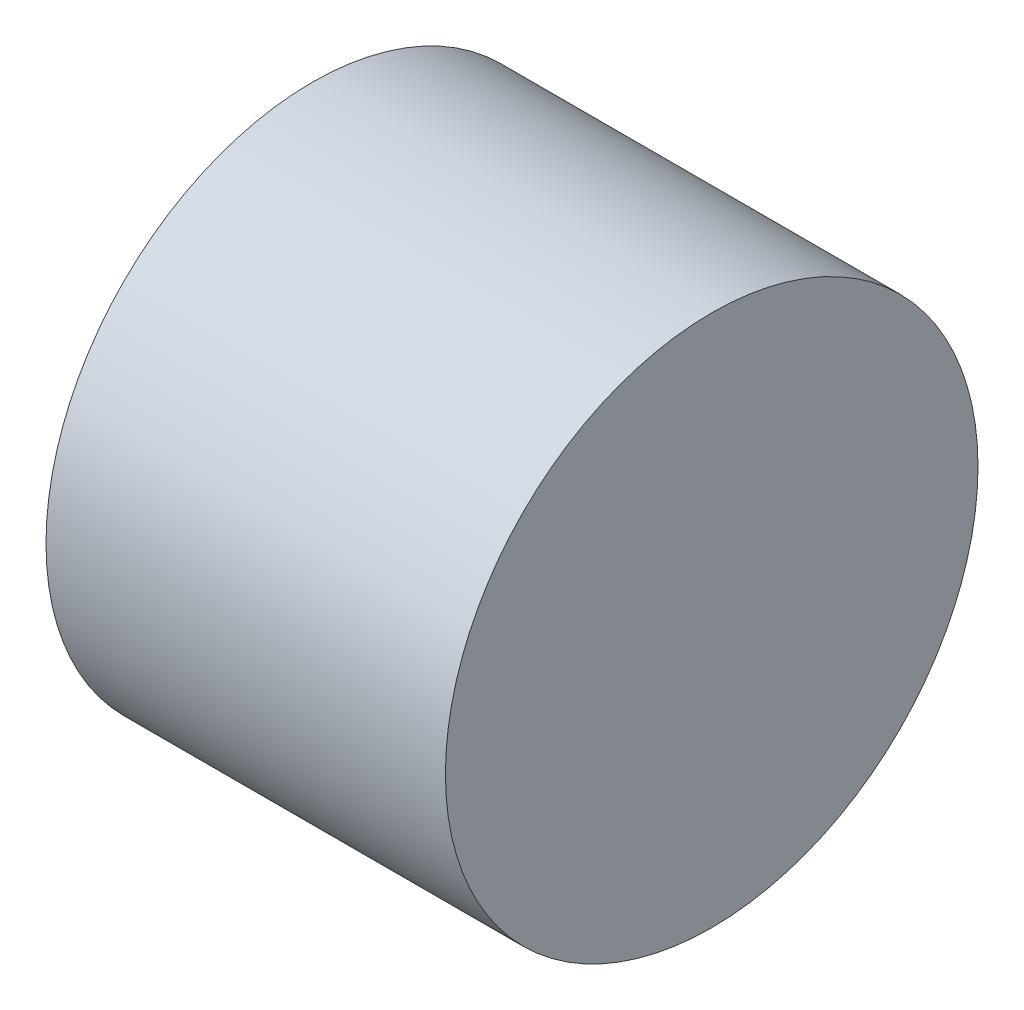
ISO-10303-21;
HEADER;
FILE_DESCRIPTION(('STEP AP214'),'2;1');
FILE_NAME('part.step','',(''),(''),'','','');
FILE_SCHEMA(('AUTOMOTIVE_DESIGN { 1 0 10303 214 1 1 1 1 }'));
ENDSEC;
DATA;
#1=APPLICATION_CONTEXT('core data for automotive mechanical design processes');
#2=APPLICATION_PROTOCOL_DEFINITION('international standard','automotive_design',2000,#1);
#3=PRODUCT_CONTEXT('',#1,'mechanical');
#4=PRODUCT('Part','Part','',(#3));
#5=PRODUCT_RELATED_PRODUCT_CATEGORY('part','',(#4));
#6=PRODUCT_DEFINITION_FORMATION('','',#4);
#7=PRODUCT_DEFINITION_CONTEXT('part definition',#1,'design');
#8=PRODUCT_DEFINITION('design','',#6,#7);
#9=PRODUCT_DEFINITION_SHAPE('','',#8);
#10=(LENGTH_UNIT() NAMED_UNIT(*) SI_UNIT(.MILLI.,.METRE.));
#11=(NAMED_UNIT(*) PLANE_ANGLE_UNIT() SI_UNIT($,.RADIAN.));
#12=(NAMED_UNIT(*) SI_UNIT($,.STERADIAN.) SOLID_ANGLE_UNIT());
#13=UNCERTAINTY_MEASURE_WITH_UNIT(LENGTH_MEASURE(1.E-05),#10,'distance_accuracy_value','');
#14=(GEOMETRIC_REPRESENTATION_CONTEXT(3) GLOBAL_UNCERTAINTY_ASSIGNED_CONTEXT((#13)) GLOBAL_UNIT_ASSIGNED_CONTEXT((#10,
#11,#12)) REPRESENTATION_CONTEXT('',''));
#15=CARTESIAN_POINT('',(0.,0.,0.));
#16=DIRECTION('',(0.,0.,1.));
#17=DIRECTION('',(1.,0.,0.));
#18=AXIS2_PLACEMENT_3D('',#15,#16,#17);
#19=CARTESIAN_POINT('',(0.381,0.,0.));
#20=DIRECTION('',(1.,0.,0.));
#21=DIRECTION('',(0.,0.,-1.));
#22=AXIS2_PLACEMENT_3D('',#19,#20,#21);
#23=PLANE('',#22);
#24=CARTESIAN_POINT('',(0.381,0.,0.));
#25=DIRECTION('',(-1.,0.,0.));
#26=DIRECTION('',(0.,0.,1.));
#27=AXIS2_PLACEMENT_3D('',#24,#25,#26);
#28=CIRCLE('',#27,0.254);
#29=CARTESIAN_POINT('',(0.381,0.,0.254));
#30=VERTEX_POINT('',#29);
#31=EDGE_CURVE('E18',#30,#30,#28,.T.);
#32=ORIENTED_EDGE('',*,*,#31,.F.);
#33=EDGE_LOOP('',(#32));
#34=FACE_BOUND('',#33,.T.);
#35=ADVANCED_FACE('F15',(#34),#23,.T.);
#36=CARTESIAN_POINT('',(0.,0.,0.));
#37=DIRECTION('',(1.,0.,0.));
#38=DIRECTION('',(0.,0.,-1.));
#39=AXIS2_PLACEMENT_3D('',#36,#37,#38);
#40=PLANE('',#39);
#41=CARTESIAN_POINT('',(0.,0.,0.));
#42=DIRECTION('',(-1.,0.,0.));
#43=DIRECTION('',(0.,0.,1.));
#44=AXIS2_PLACEMENT_3D('',#41,#42,#43);
#45=CIRCLE('',#44,0.254);
#46=CARTESIAN_POINT('',(0.,0.,0.254));
#47=VERTEX_POINT('',#46);
#48=EDGE_CURVE('E10',#47,#47,#45,.F.);
#49=ORIENTED_EDGE('',*,*,#48,.F.);
#50=EDGE_LOOP('',(#49));
#51=FACE_BOUND('',#50,.T.);
#52=ADVANCED_FACE('F30',(#51),#40,.F.);
#53=CARTESIAN_POINT('',(0.381,0.,0.));
#54=DIRECTION('',(-1.,0.,0.));
#55=DIRECTION('',(0.,0.,1.));
#56=AXIS2_PLACEMENT_3D('',#53,#54,#55);
#57=CYLINDRICAL_SURFACE('',#56,0.254);
#58=ORIENTED_EDGE('',*,*,#48,.T.);
#59=EDGE_LOOP('',(#58));
#60=FACE_BOUND('',#59,.T.);
#61=ORIENTED_EDGE('',*,*,#31,.T.);
#62=EDGE_LOOP('',(#61));
#63=FACE_BOUND('',#62,.T.);
#64=ADVANCED_FACE('F27',(#60,#63),#57,.T.);
#65=CLOSED_SHELL('',(#35,#52,#64));
#66=MANIFOLD_SOLID_BREP('B1',#65);
#67=ADVANCED_BREP_SHAPE_REPRESENTATION('',(#18,#66),#14);
#68=SHAPE_DEFINITION_REPRESENTATION(#9,#67);
ENDSEC;
END-ISO-10303-21;
